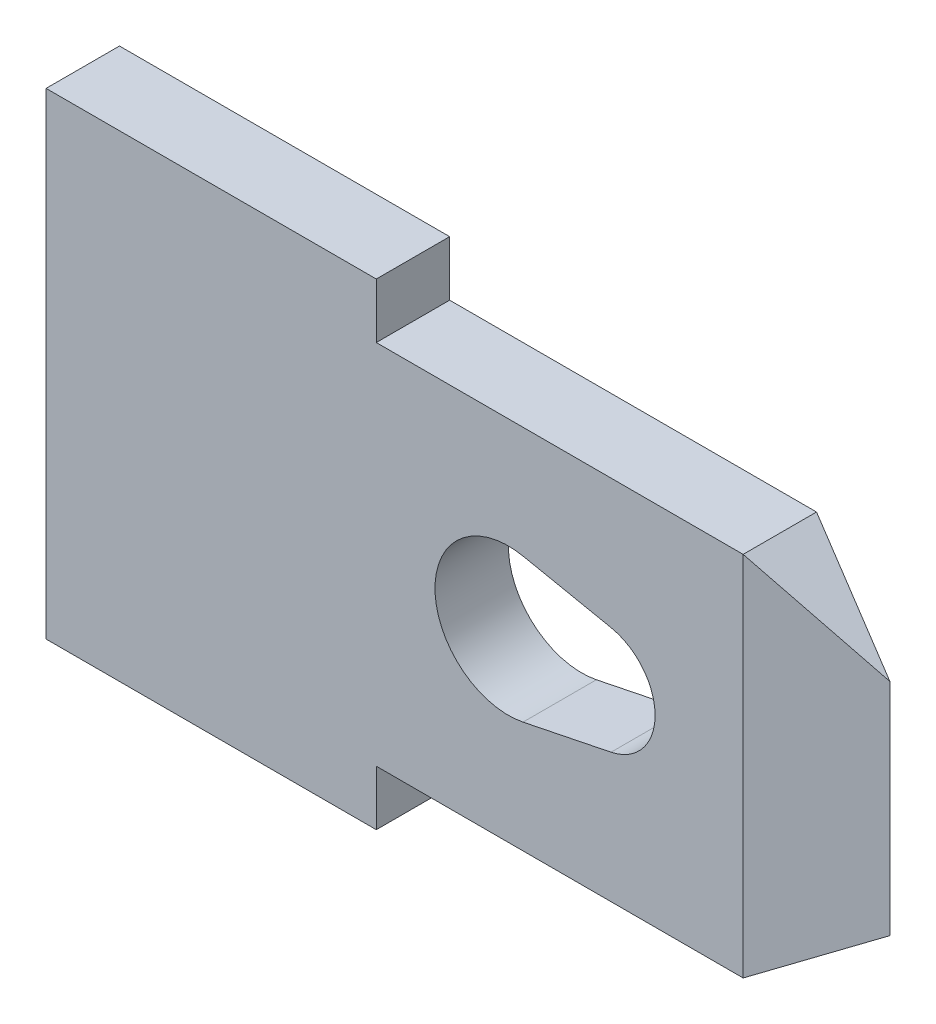
ISO-10303-21;
HEADER;
FILE_DESCRIPTION(('STEP AP214'),'2;1');
FILE_NAME('part.step','',(''),(''),'','','');
FILE_SCHEMA(('AUTOMOTIVE_DESIGN { 1 0 10303 214 1 1 1 1 }'));
ENDSEC;
DATA;
#1=APPLICATION_CONTEXT('core data for automotive mechanical design processes');
#2=APPLICATION_PROTOCOL_DEFINITION('international standard','automotive_design',2000,#1);
#3=PRODUCT_CONTEXT('',#1,'mechanical');
#4=PRODUCT('Part','Part','',(#3));
#5=PRODUCT_RELATED_PRODUCT_CATEGORY('part','',(#4));
#6=PRODUCT_DEFINITION_FORMATION('','',#4);
#7=PRODUCT_DEFINITION_CONTEXT('part definition',#1,'design');
#8=PRODUCT_DEFINITION('design','',#6,#7);
#9=PRODUCT_DEFINITION_SHAPE('','',#8);
#10=(LENGTH_UNIT() NAMED_UNIT(*) SI_UNIT(.MILLI.,.METRE.));
#11=(NAMED_UNIT(*) PLANE_ANGLE_UNIT() SI_UNIT($,.RADIAN.));
#12=(NAMED_UNIT(*) SI_UNIT($,.STERADIAN.) SOLID_ANGLE_UNIT());
#13=UNCERTAINTY_MEASURE_WITH_UNIT(LENGTH_MEASURE(1.E-05),#10,'distance_accuracy_value','');
#14=(GEOMETRIC_REPRESENTATION_CONTEXT(3) GLOBAL_UNCERTAINTY_ASSIGNED_CONTEXT((#13)) GLOBAL_UNIT_ASSIGNED_CONTEXT((#10,
#11,#12)) REPRESENTATION_CONTEXT('',''));
#15=CARTESIAN_POINT('',(0.,0.,0.));
#16=DIRECTION('',(0.,0.,1.));
#17=DIRECTION('',(1.,0.,0.));
#18=AXIS2_PLACEMENT_3D('',#15,#16,#17);
#19=CARTESIAN_POINT('',(9.5,-2.5,1.));
#20=DIRECTION('',(-0.554700196225229,0.832050294337844,0.));
#21=DIRECTION('',(-0.832050294337844,-0.554700196225229,0.));
#22=AXIS2_PLACEMENT_3D('',#19,#20,#21);
#23=PLANE('',#22);
#24=DIRECTION('',(0.801783725737273,0.534522483824849,0.267261241912424));
#25=VECTOR('',#24,1.);
#26=CARTESIAN_POINT('',(3.071,-6.786,-2.143));
#27=LINE('',#26,#25);
#28=CARTESIAN_POINT('',(9.5,-2.5,0.));
#29=VERTEX_POINT('',#28);
#30=CARTESIAN_POINT('',(11.,-1.5,0.499999999999999));
#31=VERTEX_POINT('',#30);
#32=EDGE_CURVE('E133',#29,#31,#27,.T.);
#33=ORIENTED_EDGE('',*,*,#32,.T.);
#34=DIRECTION('',(-0.801783725737273,-0.534522483824849,0.267261241912424));
#35=VECTOR('',#34,1.);
#36=CARTESIAN_POINT('',(3.28528571428572,-6.64314285714286,3.07157142857143));
#37=LINE('',#36,#35);
#38=CARTESIAN_POINT('',(9.5,-2.5,1.));
#39=VERTEX_POINT('',#38);
#40=EDGE_CURVE('E222',#31,#39,#37,.T.);
#41=ORIENTED_EDGE('',*,*,#40,.T.);
#42=DIRECTION('',(0.,0.,-1.));
#43=VECTOR('',#42,1.);
#44=CARTESIAN_POINT('',(9.5,-2.5,1.));
#45=LINE('',#44,#43);
#46=EDGE_CURVE('E176',#39,#29,#45,.T.);
#47=ORIENTED_EDGE('',*,*,#46,.T.);
#48=EDGE_LOOP('',(#33,#41,#47));
#49=FACE_BOUND('',#48,.T.);
#50=ADVANCED_FACE('F33',(#49),#23,.F.);
#51=CARTESIAN_POINT('',(9.5,2.5,1.));
#52=DIRECTION('',(-0.554700196225229,-0.832050294337844,0.));
#53=DIRECTION('',(0.832050294337844,-0.554700196225229,0.));
#54=AXIS2_PLACEMENT_3D('',#51,#52,#53);
#55=PLANE('',#54);
#56=DIRECTION('',(-0.801783725737273,0.534522483824849,-0.267261241912424));
#57=VECTOR('',#56,1.);
#58=CARTESIAN_POINT('',(5.85757142857143,4.92828571428571,-1.21414285714286));
#59=LINE('',#58,#57);
#60=CARTESIAN_POINT('',(11.,1.5,0.5));
#61=VERTEX_POINT('',#60);
#62=CARTESIAN_POINT('',(9.5,2.5,0.));
#63=VERTEX_POINT('',#62);
#64=EDGE_CURVE('E130',#61,#63,#59,.T.);
#65=ORIENTED_EDGE('',*,*,#64,.T.);
#66=DIRECTION('',(0.,0.,-1.));
#67=VECTOR('',#66,1.);
#68=CARTESIAN_POINT('',(9.5,2.5,1.));
#69=LINE('',#68,#67);
#70=CARTESIAN_POINT('',(9.5,2.5,1.));
#71=VERTEX_POINT('',#70);
#72=EDGE_CURVE('E12',#71,#63,#69,.T.);
#73=ORIENTED_EDGE('',*,*,#72,.F.);
#74=DIRECTION('',(0.801783725737273,-0.534522483824849,-0.267261241912424));
#75=VECTOR('',#74,1.);
#76=CARTESIAN_POINT('',(6.07185714285714,4.78542857142857,2.14271428571429));
#77=LINE('',#76,#75);
#78=EDGE_CURVE('E138',#71,#61,#77,.T.);
#79=ORIENTED_EDGE('',*,*,#78,.T.);
#80=EDGE_LOOP('',(#65,#73,#79));
#81=FACE_BOUND('',#80,.T.);
#82=ADVANCED_FACE('F143',(#81),#55,.F.);
#83=CARTESIAN_POINT('',(0.,0.,0.));
#84=DIRECTION('',(0.,0.,-1.));
#85=DIRECTION('',(-1.,0.,0.));
#86=AXIS2_PLACEMENT_3D('',#83,#84,#85);
#87=PLANE('',#86);
#88=CARTESIAN_POINT('',(6.3,0.,0.));
#89=DIRECTION('',(0.,0.,-1.));
#90=DIRECTION('',(-1.,0.,0.));
#91=AXIS2_PLACEMENT_3D('',#88,#89,#90);
#92=CIRCLE('',#91,1.);
#93=CARTESIAN_POINT('',(6.5,0.979795897113271,0.));
#94=VERTEX_POINT('',#93);
#95=CARTESIAN_POINT('',(6.5,-0.979795897113272,0.));
#96=VERTEX_POINT('',#95);
#97=EDGE_CURVE('E236',#94,#96,#92,.F.);
#98=ORIENTED_EDGE('',*,*,#97,.T.);
#99=DIRECTION('',(0.979795897113271,0.2,0.));
#100=VECTOR('',#99,1.);
#101=CARTESIAN_POINT('',(6.5,-0.979795897113272,0.));
#102=LINE('',#101,#100);
#103=CARTESIAN_POINT('',(7.7,-0.734846922834954,0.));
#104=VERTEX_POINT('',#103);
#105=EDGE_CURVE('E156',#96,#104,#102,.T.);
#106=ORIENTED_EDGE('',*,*,#105,.T.);
#107=CARTESIAN_POINT('',(7.55,0.,0.));
#108=DIRECTION('',(0.,0.,-1.));
#109=DIRECTION('',(-1.,0.,0.));
#110=AXIS2_PLACEMENT_3D('',#107,#108,#109);
#111=CIRCLE('',#110,0.75);
#112=CARTESIAN_POINT('',(7.7,0.734846922834953,0.));
#113=VERTEX_POINT('',#112);
#114=EDGE_CURVE('E229',#104,#113,#111,.F.);
#115=ORIENTED_EDGE('',*,*,#114,.T.);
#116=DIRECTION('',(-0.979795897113271,0.2,0.));
#117=VECTOR('',#116,1.);
#118=CARTESIAN_POINT('',(6.5,0.979795897113271,0.));
#119=LINE('',#118,#117);
#120=EDGE_CURVE('E233',#113,#94,#119,.T.);
#121=ORIENTED_EDGE('',*,*,#120,.T.);
#122=EDGE_LOOP('',(#98,#106,#115,#121));
#123=FACE_BOUND('',#122,.T.);
#124=DIRECTION('',(-1.,0.,0.));
#125=VECTOR('',#124,1.);
#126=CARTESIAN_POINT('',(4.5,2.5,0.));
#127=LINE('',#126,#125);
#128=CARTESIAN_POINT('',(4.5,2.5,0.));
#129=VERTEX_POINT('',#128);
#130=EDGE_CURVE('E149',#63,#129,#127,.T.);
#131=ORIENTED_EDGE('',*,*,#130,.F.);
#132=DIRECTION('',(0.,1.,0.));
#133=VECTOR('',#132,1.);
#134=CARTESIAN_POINT('',(9.5,-3.251,0.));
#135=LINE('',#134,#133);
#136=EDGE_CURVE('E127',#29,#63,#135,.T.);
#137=ORIENTED_EDGE('',*,*,#136,.F.);
#138=DIRECTION('',(1.,0.,0.));
#139=VECTOR('',#138,1.);
#140=CARTESIAN_POINT('',(4.5,-2.5,0.));
#141=LINE('',#140,#139);
#142=CARTESIAN_POINT('',(4.5,-2.5,0.));
#143=VERTEX_POINT('',#142);
#144=EDGE_CURVE('E174',#143,#29,#141,.T.);
#145=ORIENTED_EDGE('',*,*,#144,.F.);
#146=DIRECTION('',(0.,1.,0.));
#147=VECTOR('',#146,1.);
#148=CARTESIAN_POINT('',(4.5,-3.25,0.));
#149=LINE('',#148,#147);
#150=CARTESIAN_POINT('',(4.5,-3.25,0.));
#151=VERTEX_POINT('',#150);
#152=EDGE_CURVE('E172',#151,#143,#149,.T.);
#153=ORIENTED_EDGE('',*,*,#152,.F.);
#154=DIRECTION('',(1.,0.,0.));
#155=VECTOR('',#154,1.);
#156=CARTESIAN_POINT('',(0.,-3.25,0.));
#157=LINE('',#156,#155);
#158=CARTESIAN_POINT('',(0.,-3.25,0.));
#159=VERTEX_POINT('',#158);
#160=EDGE_CURVE('E170',#159,#151,#157,.T.);
#161=ORIENTED_EDGE('',*,*,#160,.F.);
#162=DIRECTION('',(0.,-1.,0.));
#163=VECTOR('',#162,1.);
#164=CARTESIAN_POINT('',(0.,-3.25,0.));
#165=LINE('',#164,#163);
#166=CARTESIAN_POINT('',(0.,3.25,0.));
#167=VERTEX_POINT('',#166);
#168=EDGE_CURVE('E168',#167,#159,#165,.T.);
#169=ORIENTED_EDGE('',*,*,#168,.F.);
#170=DIRECTION('',(-1.,0.,0.));
#171=VECTOR('',#170,1.);
#172=CARTESIAN_POINT('',(0.,3.25,0.));
#173=LINE('',#172,#171);
#174=CARTESIAN_POINT('',(4.5,3.25,0.));
#175=VERTEX_POINT('',#174);
#176=EDGE_CURVE('E158',#175,#167,#173,.T.);
#177=ORIENTED_EDGE('',*,*,#176,.F.);
#178=DIRECTION('',(0.,1.,0.));
#179=VECTOR('',#178,1.);
#180=CARTESIAN_POINT('',(4.5,3.25,0.));
#181=LINE('',#180,#179);
#182=EDGE_CURVE('E155',#129,#175,#181,.T.);
#183=ORIENTED_EDGE('',*,*,#182,.F.);
#184=EDGE_LOOP('',(#131,#137,#145,#153,#161,#169,#177,#183));
#185=FACE_BOUND('',#184,.T.);
#186=ADVANCED_FACE('F153',(#123,#185),#87,.T.);
#187=CARTESIAN_POINT('',(0.,0.,1.));
#188=DIRECTION('',(0.,0.,-1.));
#189=DIRECTION('',(-1.,0.,0.));
#190=AXIS2_PLACEMENT_3D('',#187,#188,#189);
#191=PLANE('',#190);
#192=DIRECTION('',(0.979795897113271,0.2,0.));
#193=VECTOR('',#192,1.);
#194=CARTESIAN_POINT('',(6.5,-0.979795897113272,1.));
#195=LINE('',#194,#193);
#196=CARTESIAN_POINT('',(6.5,-0.979795897113271,1.));
#197=VERTEX_POINT('',#196);
#198=CARTESIAN_POINT('',(7.7,-0.734846922834954,1.));
#199=VERTEX_POINT('',#198);
#200=EDGE_CURVE('E240',#197,#199,#195,.T.);
#201=ORIENTED_EDGE('',*,*,#200,.F.);
#202=CARTESIAN_POINT('',(6.3,0.,1.));
#203=DIRECTION('',(0.,0.,1.));
#204=DIRECTION('',(1.,0.,0.));
#205=AXIS2_PLACEMENT_3D('',#202,#203,#204);
#206=CIRCLE('',#205,1.);
#207=CARTESIAN_POINT('',(6.5,0.979795897113271,1.));
#208=VERTEX_POINT('',#207);
#209=EDGE_CURVE('E47',#208,#197,#206,.T.);
#210=ORIENTED_EDGE('',*,*,#209,.F.);
#211=DIRECTION('',(-0.979795897113271,0.2,0.));
#212=VECTOR('',#211,1.);
#213=CARTESIAN_POINT('',(6.5,0.979795897113271,1.));
#214=LINE('',#213,#212);
#215=CARTESIAN_POINT('',(7.7,0.734846922834953,1.));
#216=VERTEX_POINT('',#215);
#217=EDGE_CURVE('E245',#216,#208,#214,.T.);
#218=ORIENTED_EDGE('',*,*,#217,.F.);
#219=CARTESIAN_POINT('',(7.55,0.,1.));
#220=DIRECTION('',(0.,0.,1.));
#221=DIRECTION('',(1.,0.,0.));
#222=AXIS2_PLACEMENT_3D('',#219,#220,#221);
#223=CIRCLE('',#222,0.75);
#224=EDGE_CURVE('E242',#199,#216,#223,.T.);
#225=ORIENTED_EDGE('',*,*,#224,.F.);
#226=EDGE_LOOP('',(#201,#210,#218,#225));
#227=FACE_BOUND('',#226,.T.);
#228=DIRECTION('',(0.,1.,0.));
#229=VECTOR('',#228,1.);
#230=CARTESIAN_POINT('',(9.5,-3.251,1.));
#231=LINE('',#230,#229);
#232=EDGE_CURVE('E216',#39,#71,#231,.T.);
#233=ORIENTED_EDGE('',*,*,#232,.T.);
#234=DIRECTION('',(-1.,0.,0.));
#235=VECTOR('',#234,1.);
#236=CARTESIAN_POINT('',(4.5,2.5,1.));
#237=LINE('',#236,#235);
#238=CARTESIAN_POINT('',(4.5,2.5,1.));
#239=VERTEX_POINT('',#238);
#240=EDGE_CURVE('E151',#71,#239,#237,.T.);
#241=ORIENTED_EDGE('',*,*,#240,.T.);
#242=DIRECTION('',(0.,1.,0.));
#243=VECTOR('',#242,1.);
#244=CARTESIAN_POINT('',(4.5,3.25,1.));
#245=LINE('',#244,#243);
#246=CARTESIAN_POINT('',(4.5,3.25,1.));
#247=VERTEX_POINT('',#246);
#248=EDGE_CURVE('E197',#239,#247,#245,.T.);
#249=ORIENTED_EDGE('',*,*,#248,.T.);
#250=DIRECTION('',(-1.,0.,0.));
#251=VECTOR('',#250,1.);
#252=CARTESIAN_POINT('',(0.,3.25,1.));
#253=LINE('',#252,#251);
#254=CARTESIAN_POINT('',(0.,3.25,1.));
#255=VERTEX_POINT('',#254);
#256=EDGE_CURVE('E200',#247,#255,#253,.T.);
#257=ORIENTED_EDGE('',*,*,#256,.T.);
#258=DIRECTION('',(0.,-1.,0.));
#259=VECTOR('',#258,1.);
#260=CARTESIAN_POINT('',(0.,-3.25,1.));
#261=LINE('',#260,#259);
#262=CARTESIAN_POINT('',(0.,-3.25,1.));
#263=VERTEX_POINT('',#262);
#264=EDGE_CURVE('E202',#255,#263,#261,.T.);
#265=ORIENTED_EDGE('',*,*,#264,.T.);
#266=DIRECTION('',(1.,0.,0.));
#267=VECTOR('',#266,1.);
#268=CARTESIAN_POINT('',(0.,-3.25,1.));
#269=LINE('',#268,#267);
#270=CARTESIAN_POINT('',(4.5,-3.25,1.));
#271=VERTEX_POINT('',#270);
#272=EDGE_CURVE('E207',#263,#271,#269,.T.);
#273=ORIENTED_EDGE('',*,*,#272,.T.);
#274=DIRECTION('',(0.,1.,0.));
#275=VECTOR('',#274,1.);
#276=CARTESIAN_POINT('',(4.5,-3.25,1.));
#277=LINE('',#276,#275);
#278=CARTESIAN_POINT('',(4.5,-2.5,1.));
#279=VERTEX_POINT('',#278);
#280=EDGE_CURVE('E208',#271,#279,#277,.T.);
#281=ORIENTED_EDGE('',*,*,#280,.T.);
#282=DIRECTION('',(1.,0.,0.));
#283=VECTOR('',#282,1.);
#284=CARTESIAN_POINT('',(4.5,-2.5,1.));
#285=LINE('',#284,#283);
#286=EDGE_CURVE('E164',#279,#39,#285,.T.);
#287=ORIENTED_EDGE('',*,*,#286,.T.);
#288=EDGE_LOOP('',(#233,#241,#249,#257,#265,#273,#281,#287));
#289=FACE_BOUND('',#288,.T.);
#290=ADVANCED_FACE('F215',(#227,#289),#191,.F.);
#291=CARTESIAN_POINT('',(4.5,2.5,1.));
#292=DIRECTION('',(0.,-1.,0.));
#293=DIRECTION('',(0.,0.,-1.));
#294=AXIS2_PLACEMENT_3D('',#291,#292,#293);
#295=PLANE('',#294);
#296=ORIENTED_EDGE('',*,*,#130,.T.);
#297=DIRECTION('',(0.,0.,-1.));
#298=VECTOR('',#297,1.);
#299=CARTESIAN_POINT('',(4.5,2.5,1.));
#300=LINE('',#299,#298);
#301=EDGE_CURVE('E40',#239,#129,#300,.T.);
#302=ORIENTED_EDGE('',*,*,#301,.F.);
#303=ORIENTED_EDGE('',*,*,#240,.F.);
#304=ORIENTED_EDGE('',*,*,#72,.T.);
#305=EDGE_LOOP('',(#296,#302,#303,#304));
#306=FACE_BOUND('',#305,.T.);
#307=ADVANCED_FACE('F147',(#306),#295,.F.);
#308=CARTESIAN_POINT('',(4.5,3.25,1.));
#309=DIRECTION('',(-1.,0.,0.));
#310=DIRECTION('',(0.,0.,1.));
#311=AXIS2_PLACEMENT_3D('',#308,#309,#310);
#312=PLANE('',#311);
#313=ORIENTED_EDGE('',*,*,#182,.T.);
#314=DIRECTION('',(0.,0.,-1.));
#315=VECTOR('',#314,1.);
#316=CARTESIAN_POINT('',(4.5,3.25,1.));
#317=LINE('',#316,#315);
#318=EDGE_CURVE('E191',#247,#175,#317,.T.);
#319=ORIENTED_EDGE('',*,*,#318,.F.);
#320=ORIENTED_EDGE('',*,*,#248,.F.);
#321=ORIENTED_EDGE('',*,*,#301,.T.);
#322=EDGE_LOOP('',(#313,#319,#320,#321));
#323=FACE_BOUND('',#322,.T.);
#324=ADVANCED_FACE('F195',(#323),#312,.F.);
#325=CARTESIAN_POINT('',(0.,3.25,1.));
#326=DIRECTION('',(0.,-1.,0.));
#327=DIRECTION('',(0.,0.,-1.));
#328=AXIS2_PLACEMENT_3D('',#325,#326,#327);
#329=PLANE('',#328);
#330=ORIENTED_EDGE('',*,*,#176,.T.);
#331=DIRECTION('',(0.,0.,-1.));
#332=VECTOR('',#331,1.);
#333=CARTESIAN_POINT('',(0.,3.25,1.));
#334=LINE('',#333,#332);
#335=EDGE_CURVE('E188',#255,#167,#334,.T.);
#336=ORIENTED_EDGE('',*,*,#335,.F.);
#337=ORIENTED_EDGE('',*,*,#256,.F.);
#338=ORIENTED_EDGE('',*,*,#318,.T.);
#339=EDGE_LOOP('',(#330,#336,#337,#338));
#340=FACE_BOUND('',#339,.T.);
#341=ADVANCED_FACE('F288',(#340),#329,.F.);
#342=CARTESIAN_POINT('',(0.,-3.25,1.));
#343=DIRECTION('',(1.,0.,0.));
#344=DIRECTION('',(0.,0.,-1.));
#345=AXIS2_PLACEMENT_3D('',#342,#343,#344);
#346=PLANE('',#345);
#347=ORIENTED_EDGE('',*,*,#168,.T.);
#348=DIRECTION('',(0.,0.,-1.));
#349=VECTOR('',#348,1.);
#350=CARTESIAN_POINT('',(0.,-3.25,1.));
#351=LINE('',#350,#349);
#352=EDGE_CURVE('E185',#263,#159,#351,.T.);
#353=ORIENTED_EDGE('',*,*,#352,.F.);
#354=ORIENTED_EDGE('',*,*,#264,.F.);
#355=ORIENTED_EDGE('',*,*,#335,.T.);
#356=EDGE_LOOP('',(#347,#353,#354,#355));
#357=FACE_BOUND('',#356,.T.);
#358=ADVANCED_FACE('F291',(#357),#346,.F.);
#359=CARTESIAN_POINT('',(0.,-3.25,1.));
#360=DIRECTION('',(0.,1.,0.));
#361=DIRECTION('',(0.,0.,1.));
#362=AXIS2_PLACEMENT_3D('',#359,#360,#361);
#363=PLANE('',#362);
#364=ORIENTED_EDGE('',*,*,#160,.T.);
#365=DIRECTION('',(0.,0.,-1.));
#366=VECTOR('',#365,1.);
#367=CARTESIAN_POINT('',(4.5,-3.25,1.));
#368=LINE('',#367,#366);
#369=EDGE_CURVE('E182',#271,#151,#368,.T.);
#370=ORIENTED_EDGE('',*,*,#369,.F.);
#371=ORIENTED_EDGE('',*,*,#272,.F.);
#372=ORIENTED_EDGE('',*,*,#352,.T.);
#373=EDGE_LOOP('',(#364,#370,#371,#372));
#374=FACE_BOUND('',#373,.T.);
#375=ADVANCED_FACE('F295',(#374),#363,.F.);
#376=CARTESIAN_POINT('',(4.5,-3.25,1.));
#377=DIRECTION('',(-1.,0.,0.));
#378=DIRECTION('',(0.,0.,1.));
#379=AXIS2_PLACEMENT_3D('',#376,#377,#378);
#380=PLANE('',#379);
#381=ORIENTED_EDGE('',*,*,#152,.T.);
#382=DIRECTION('',(0.,0.,-1.));
#383=VECTOR('',#382,1.);
#384=CARTESIAN_POINT('',(4.5,-2.5,1.));
#385=LINE('',#384,#383);
#386=EDGE_CURVE('E179',#279,#143,#385,.T.);
#387=ORIENTED_EDGE('',*,*,#386,.F.);
#388=ORIENTED_EDGE('',*,*,#280,.F.);
#389=ORIENTED_EDGE('',*,*,#369,.T.);
#390=EDGE_LOOP('',(#381,#387,#388,#389));
#391=FACE_BOUND('',#390,.T.);
#392=ADVANCED_FACE('F299',(#391),#380,.F.);
#393=CARTESIAN_POINT('',(4.5,-2.5,1.));
#394=DIRECTION('',(0.,1.,0.));
#395=DIRECTION('',(0.,0.,1.));
#396=AXIS2_PLACEMENT_3D('',#393,#394,#395);
#397=PLANE('',#396);
#398=ORIENTED_EDGE('',*,*,#144,.T.);
#399=ORIENTED_EDGE('',*,*,#46,.F.);
#400=ORIENTED_EDGE('',*,*,#286,.F.);
#401=ORIENTED_EDGE('',*,*,#386,.T.);
#402=EDGE_LOOP('',(#398,#399,#400,#401));
#403=FACE_BOUND('',#402,.T.);
#404=ADVANCED_FACE('F218',(#403),#397,.F.);
#405=CARTESIAN_POINT('',(6.3,0.,-0.000999999999999916));
#406=DIRECTION('',(0.,0.,1.));
#407=DIRECTION('',(1.,0.,0.));
#408=AXIS2_PLACEMENT_3D('',#405,#406,#407);
#409=CYLINDRICAL_SURFACE('',#408,1.);
#410=DIRECTION('',(0.,0.,1.));
#411=VECTOR('',#410,1.);
#412=CARTESIAN_POINT('',(6.5,0.979795897113271,-0.000999999999999916));
#413=LINE('',#412,#411);
#414=EDGE_CURVE('E161',#94,#208,#413,.T.);
#415=ORIENTED_EDGE('',*,*,#414,.T.);
#416=ORIENTED_EDGE('',*,*,#209,.T.);
#417=DIRECTION('',(0.,0.,1.));
#418=VECTOR('',#417,1.);
#419=CARTESIAN_POINT('',(6.5,-0.979795897113272,-0.000999999999999916));
#420=LINE('',#419,#418);
#421=EDGE_CURVE('E248',#96,#197,#420,.T.);
#422=ORIENTED_EDGE('',*,*,#421,.F.);
#423=ORIENTED_EDGE('',*,*,#97,.F.);
#424=EDGE_LOOP('',(#415,#416,#422,#423));
#425=FACE_BOUND('',#424,.T.);
#426=ADVANCED_FACE('F263',(#425),#409,.F.);
#427=CARTESIAN_POINT('',(6.5,0.979795897113271,-0.000999999999999916));
#428=DIRECTION('',(0.2,0.979795897113271,0.));
#429=DIRECTION('',(-0.979795897113271,0.2,0.));
#430=AXIS2_PLACEMENT_3D('',#427,#428,#429);
#431=PLANE('',#430);
#432=DIRECTION('',(0.,0.,1.));
#433=VECTOR('',#432,1.);
#434=CARTESIAN_POINT('',(7.7,0.734846922834953,-0.000999999999999916));
#435=LINE('',#434,#433);
#436=EDGE_CURVE('E250',#113,#216,#435,.T.);
#437=ORIENTED_EDGE('',*,*,#436,.T.);
#438=ORIENTED_EDGE('',*,*,#217,.T.);
#439=ORIENTED_EDGE('',*,*,#414,.F.);
#440=ORIENTED_EDGE('',*,*,#120,.F.);
#441=EDGE_LOOP('',(#437,#438,#439,#440));
#442=FACE_BOUND('',#441,.T.);
#443=ADVANCED_FACE('F265',(#442),#431,.F.);
#444=CARTESIAN_POINT('',(7.55,0.,-0.000999999999999916));
#445=DIRECTION('',(0.,0.,1.));
#446=DIRECTION('',(1.,0.,0.));
#447=AXIS2_PLACEMENT_3D('',#444,#445,#446);
#448=CYLINDRICAL_SURFACE('',#447,0.75);
#449=DIRECTION('',(0.,0.,1.));
#450=VECTOR('',#449,1.);
#451=CARTESIAN_POINT('',(7.7,-0.734846922834954,-0.000999999999999916));
#452=LINE('',#451,#450);
#453=EDGE_CURVE('E55',#104,#199,#452,.T.);
#454=ORIENTED_EDGE('',*,*,#453,.T.);
#455=ORIENTED_EDGE('',*,*,#224,.T.);
#456=ORIENTED_EDGE('',*,*,#436,.F.);
#457=ORIENTED_EDGE('',*,*,#114,.F.);
#458=EDGE_LOOP('',(#454,#455,#456,#457));
#459=FACE_BOUND('',#458,.T.);
#460=ADVANCED_FACE('F260',(#459),#448,.F.);
#461=CARTESIAN_POINT('',(6.5,-0.979795897113272,-0.000999999999999916));
#462=DIRECTION('',(0.2,-0.979795897113271,0.));
#463=DIRECTION('',(0.979795897113271,0.2,0.));
#464=AXIS2_PLACEMENT_3D('',#461,#462,#463);
#465=PLANE('',#464);
#466=ORIENTED_EDGE('',*,*,#421,.T.);
#467=ORIENTED_EDGE('',*,*,#200,.T.);
#468=ORIENTED_EDGE('',*,*,#453,.F.);
#469=ORIENTED_EDGE('',*,*,#105,.F.);
#470=EDGE_LOOP('',(#466,#467,#468,#469));
#471=FACE_BOUND('',#470,.T.);
#472=ADVANCED_FACE('F254',(#471),#465,.F.);
#473=CARTESIAN_POINT('',(1.25,-3.251,3.75));
#474=DIRECTION('',(0.316227766016838,0.,0.948683298050514));
#475=DIRECTION('',(0.948683298050514,0.,-0.316227766016838));
#476=AXIS2_PLACEMENT_3D('',#473,#474,#475);
#477=PLANE('',#476);
#478=DIRECTION('',(0.,1.,0.));
#479=VECTOR('',#478,1.);
#480=CARTESIAN_POINT('',(11.,-3.251,0.5));
#481=LINE('',#480,#479);
#482=EDGE_CURVE('E224',#31,#61,#481,.T.);
#483=ORIENTED_EDGE('',*,*,#482,.T.);
#484=ORIENTED_EDGE('',*,*,#78,.F.);
#485=ORIENTED_EDGE('',*,*,#232,.F.);
#486=ORIENTED_EDGE('',*,*,#40,.F.);
#487=EDGE_LOOP('',(#483,#484,#485,#486));
#488=FACE_BOUND('',#487,.T.);
#489=ADVANCED_FACE('F309',(#488),#477,.T.);
#490=CARTESIAN_POINT('',(0.950000000000001,-3.251,-2.85));
#491=DIRECTION('',(0.316227766016838,0.,-0.948683298050514));
#492=DIRECTION('',(-0.948683298050514,0.,-0.316227766016838));
#493=AXIS2_PLACEMENT_3D('',#490,#491,#492);
#494=PLANE('',#493);
#495=ORIENTED_EDGE('',*,*,#136,.T.);
#496=ORIENTED_EDGE('',*,*,#64,.F.);
#497=ORIENTED_EDGE('',*,*,#482,.F.);
#498=ORIENTED_EDGE('',*,*,#32,.F.);
#499=EDGE_LOOP('',(#495,#496,#497,#498));
#500=FACE_BOUND('',#499,.T.);
#501=ADVANCED_FACE('F129',(#500),#494,.T.);
#502=CLOSED_SHELL('',(#50,#82,#186,#290,#307,#324,#341,#358,#375,#392,#404,#426,#443,#460,#472,
#489,#501));
#503=MANIFOLD_SOLID_BREP('B2',#502);
#504=ADVANCED_BREP_SHAPE_REPRESENTATION('',(#18,#503),#14);
#505=SHAPE_DEFINITION_REPRESENTATION(#9,#504);
ENDSEC;
END-ISO-10303-21;
